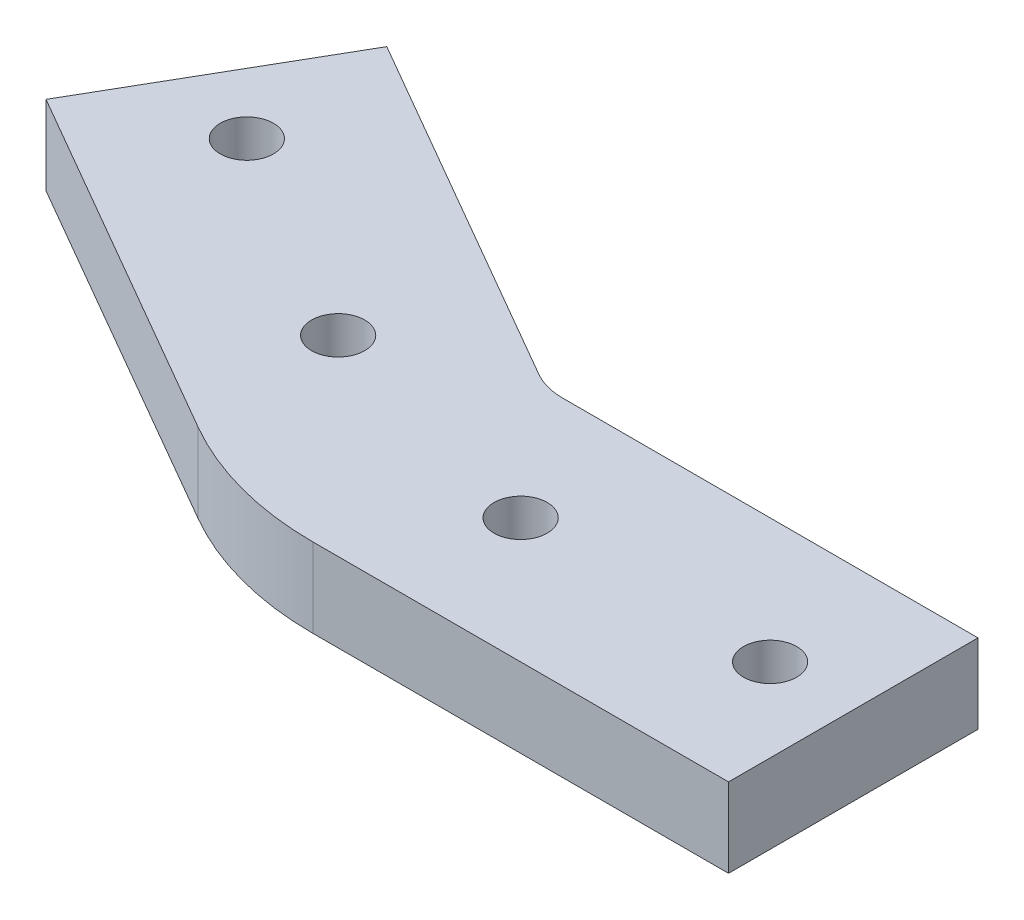
ISO-10303-21;
HEADER;
FILE_DESCRIPTION(('STEP AP214'),'2;1');
FILE_NAME('part.step','',(''),(''),'','','');
FILE_SCHEMA(('AUTOMOTIVE_DESIGN { 1 0 10303 214 1 1 1 1 }'));
ENDSEC;
DATA;
#1=APPLICATION_CONTEXT('core data for automotive mechanical design processes');
#2=APPLICATION_PROTOCOL_DEFINITION('international standard','automotive_design',2000,#1);
#3=PRODUCT_CONTEXT('',#1,'mechanical');
#4=PRODUCT('Part','Part','',(#3));
#5=PRODUCT_RELATED_PRODUCT_CATEGORY('part','',(#4));
#6=PRODUCT_DEFINITION_FORMATION('','',#4);
#7=PRODUCT_DEFINITION_CONTEXT('part definition',#1,'design');
#8=PRODUCT_DEFINITION('design','',#6,#7);
#9=PRODUCT_DEFINITION_SHAPE('','',#8);
#10=(LENGTH_UNIT() NAMED_UNIT(*) SI_UNIT(.MILLI.,.METRE.));
#11=(NAMED_UNIT(*) PLANE_ANGLE_UNIT() SI_UNIT($,.RADIAN.));
#12=(NAMED_UNIT(*) SI_UNIT($,.STERADIAN.) SOLID_ANGLE_UNIT());
#13=UNCERTAINTY_MEASURE_WITH_UNIT(LENGTH_MEASURE(1.E-05),#10,'distance_accuracy_value','');
#14=(GEOMETRIC_REPRESENTATION_CONTEXT(3) GLOBAL_UNCERTAINTY_ASSIGNED_CONTEXT((#13)) GLOBAL_UNIT_ASSIGNED_CONTEXT((#10,
#11,#12)) REPRESENTATION_CONTEXT('',''));
#15=CARTESIAN_POINT('',(0.,0.,0.));
#16=DIRECTION('',(0.,0.,1.));
#17=DIRECTION('',(1.,0.,0.));
#18=AXIS2_PLACEMENT_3D('',#15,#16,#17);
#19=CARTESIAN_POINT('',(3.03310946658286,4.7625,-11.3197186342055));
#20=DIRECTION('',(0.,-1.,0.));
#21=DIRECTION('',(0.,0.,-1.));
#22=AXIS2_PLACEMENT_3D('',#19,#20,#21);
#23=PLANE('',#22);
#24=CARTESIAN_POINT('',(-19.9472579262087,4.7625,-11.5165547332913));
#25=DIRECTION('',(0.,1.,0.));
#26=DIRECTION('',(0.,0.,1.));
#27=AXIS2_PLACEMENT_3D('',#24,#25,#26);
#28=CIRCLE('',#27,1.6);
#29=CARTESIAN_POINT('',(-19.9472579262087,4.7625,-9.91655473329132));
#30=VERTEX_POINT('',#29);
#31=EDGE_CURVE('E188',#30,#30,#28,.T.);
#32=ORIENTED_EDGE('',*,*,#31,.F.);
#33=EDGE_LOOP('',(#32));
#34=FACE_BOUND('',#33,.T.);
#35=CARTESIAN_POINT('',(23.0331094665829,4.7625,0.));
#36=DIRECTION('',(0.,1.,0.));
#37=DIRECTION('',(0.,0.,1.));
#38=AXIS2_PLACEMENT_3D('',#35,#36,#37);
#39=CIRCLE('',#38,1.6);
#40=CARTESIAN_POINT('',(23.0331094665829,4.7625,1.6));
#41=VERTEX_POINT('',#40);
#42=EDGE_CURVE('E134',#41,#41,#39,.T.);
#43=ORIENTED_EDGE('',*,*,#42,.F.);
#44=EDGE_LOOP('',(#43));
#45=FACE_BOUND('',#44,.T.);
#46=DIRECTION('',(-1.,0.,0.));
#47=VECTOR('',#46,1.);
#48=CARTESIAN_POINT('',(3.03310946658286,4.7625,-7.5));
#49=LINE('',#48,#47);
#50=CARTESIAN_POINT('',(28.0331094665829,4.7625,-7.50000000000001));
#51=VERTEX_POINT('',#50);
#52=CARTESIAN_POINT('',(3.03310946658286,4.7625,-7.5));
#53=VERTEX_POINT('',#52);
#54=EDGE_CURVE('E145',#51,#53,#49,.T.);
#55=ORIENTED_EDGE('',*,*,#54,.T.);
#56=CARTESIAN_POINT('',(3.03310946658286,4.7625,-11.3197186342055));
#57=DIRECTION('',(0.,-1.,0.));
#58=DIRECTION('',(0.,0.,1.));
#59=AXIS2_PLACEMENT_3D('',#56,#57,#58);
#60=CIRCLE('',#59,3.81971863420553);
#61=CARTESIAN_POINT('',(1.12325014948011,4.7625,-8.01174526167473));
#62=VERTEX_POINT('',#61);
#63=EDGE_CURVE('E93',#53,#62,#60,.T.);
#64=ORIENTED_EDGE('',*,*,#63,.T.);
#65=DIRECTION('',(-0.866025403784442,0.,-0.499999999999995));
#66=VECTOR('',#65,1.);
#67=CARTESIAN_POINT('',(-20.5273849451309,4.7625,-20.5117452616746));
#68=LINE('',#67,#66);
#69=CARTESIAN_POINT('',(-20.5273849451309,4.7625,-20.5117452616746));
#70=VERTEX_POINT('',#69);
#71=EDGE_CURVE('E160',#62,#70,#68,.T.);
#72=ORIENTED_EDGE('',*,*,#71,.T.);
#73=DIRECTION('',(-0.499999999999995,0.,0.866025403784441));
#74=VECTOR('',#73,1.);
#75=CARTESIAN_POINT('',(-28.0273849451308,4.7625,-7.52136420490798));
#76=LINE('',#75,#74);
#77=CARTESIAN_POINT('',(-28.0273849451308,4.7625,-7.52136420490798));
#78=VERTEX_POINT('',#77);
#79=EDGE_CURVE('E173',#70,#78,#76,.T.);
#80=ORIENTED_EDGE('',*,*,#79,.T.);
#81=DIRECTION('',(0.866025403784442,0.,0.499999999999995));
#82=VECTOR('',#81,1.);
#83=CARTESIAN_POINT('',(-6.37674985051981,4.7625,4.97863579509189));
#84=LINE('',#83,#82);
#85=CARTESIAN_POINT('',(-6.37674985051981,4.7625,4.9786357950919));
#86=VERTEX_POINT('',#85);
#87=EDGE_CURVE('E112',#78,#86,#84,.T.);
#88=ORIENTED_EDGE('',*,*,#87,.T.);
#89=CARTESIAN_POINT('',(3.03310946658286,4.7625,-11.3197186342055));
#90=DIRECTION('',(0.,1.,0.));
#91=DIRECTION('',(0.,0.,-1.));
#92=AXIS2_PLACEMENT_3D('',#89,#90,#91);
#93=CIRCLE('',#92,18.8197186342055);
#94=CARTESIAN_POINT('',(3.03310946658286,4.7625,7.5));
#95=VERTEX_POINT('',#94);
#96=EDGE_CURVE('E106',#86,#95,#93,.T.);
#97=ORIENTED_EDGE('',*,*,#96,.T.);
#98=DIRECTION('',(1.,0.,0.));
#99=VECTOR('',#98,1.);
#100=CARTESIAN_POINT('',(28.0331094665829,4.7625,7.49999999999999));
#101=LINE('',#100,#99);
#102=CARTESIAN_POINT('',(28.0331094665829,4.7625,7.49999999999999));
#103=VERTEX_POINT('',#102);
#104=EDGE_CURVE('E110',#95,#103,#101,.T.);
#105=ORIENTED_EDGE('',*,*,#104,.T.);
#106=DIRECTION('',(0.,0.,-1.));
#107=VECTOR('',#106,1.);
#108=CARTESIAN_POINT('',(28.0331094665829,4.7625,-7.50000000000001));
#109=LINE('',#108,#107);
#110=EDGE_CURVE('E50',#103,#51,#109,.T.);
#111=ORIENTED_EDGE('',*,*,#110,.T.);
#112=EDGE_LOOP('',(#55,#64,#72,#80,#88,#97,#105,#111));
#113=FACE_BOUND('',#112,.T.);
#114=CARTESIAN_POINT('',(8.03310946658287,4.7625,0.));
#115=DIRECTION('',(0.,1.,0.));
#116=DIRECTION('',(0.,0.,1.));
#117=AXIS2_PLACEMENT_3D('',#114,#115,#116);
#118=CIRCLE('',#117,1.6);
#119=CARTESIAN_POINT('',(8.03310946658287,4.7625,1.6));
#120=VERTEX_POINT('',#119);
#121=EDGE_CURVE('E182',#120,#120,#118,.T.);
#122=ORIENTED_EDGE('',*,*,#121,.F.);
#123=EDGE_LOOP('',(#122));
#124=FACE_BOUND('',#123,.T.);
#125=CARTESIAN_POINT('',(-6.95687686944206,4.7625,-4.0165547332914));
#126=DIRECTION('',(0.,1.,0.));
#127=DIRECTION('',(0.,0.,1.));
#128=AXIS2_PLACEMENT_3D('',#125,#126,#127);
#129=CIRCLE('',#128,1.6);
#130=CARTESIAN_POINT('',(-6.95687686944206,4.7625,-2.4165547332914));
#131=VERTEX_POINT('',#130);
#132=EDGE_CURVE('E194',#131,#131,#129,.T.);
#133=ORIENTED_EDGE('',*,*,#132,.F.);
#134=EDGE_LOOP('',(#133));
#135=FACE_BOUND('',#134,.T.);
#136=ADVANCED_FACE('F33',(#34,#45,#113,#124,#135),#23,.F.);
#137=CARTESIAN_POINT('',(3.03310946658286,0.,-11.3197186342055));
#138=DIRECTION('',(0.,-1.,0.));
#139=DIRECTION('',(0.,0.,-1.));
#140=AXIS2_PLACEMENT_3D('',#137,#138,#139);
#141=PLANE('',#140);
#142=CARTESIAN_POINT('',(-19.9472579262087,0.,-11.5165547332913));
#143=DIRECTION('',(0.,1.,0.));
#144=DIRECTION('',(0.,0.,1.));
#145=AXIS2_PLACEMENT_3D('',#142,#143,#144);
#146=CIRCLE('',#145,1.6);
#147=CARTESIAN_POINT('',(-19.9472579262087,0.,-9.91655473329132));
#148=VERTEX_POINT('',#147);
#149=EDGE_CURVE('E191',#148,#148,#146,.T.);
#150=ORIENTED_EDGE('',*,*,#149,.T.);
#151=EDGE_LOOP('',(#150));
#152=FACE_BOUND('',#151,.T.);
#153=CARTESIAN_POINT('',(23.0331094665829,0.,0.));
#154=DIRECTION('',(0.,1.,0.));
#155=DIRECTION('',(0.,0.,1.));
#156=AXIS2_PLACEMENT_3D('',#153,#154,#155);
#157=CIRCLE('',#156,1.6);
#158=CARTESIAN_POINT('',(23.0331094665829,0.,1.6));
#159=VERTEX_POINT('',#158);
#160=EDGE_CURVE('E179',#159,#159,#157,.T.);
#161=ORIENTED_EDGE('',*,*,#160,.T.);
#162=EDGE_LOOP('',(#161));
#163=FACE_BOUND('',#162,.T.);
#164=DIRECTION('',(-1.,0.,0.));
#165=VECTOR('',#164,1.);
#166=CARTESIAN_POINT('',(3.03310946658286,0.,-7.5));
#167=LINE('',#166,#165);
#168=CARTESIAN_POINT('',(28.0331094665829,0.,-7.50000000000001));
#169=VERTEX_POINT('',#168);
#170=CARTESIAN_POINT('',(3.03310946658286,0.,-7.5));
#171=VERTEX_POINT('',#170);
#172=EDGE_CURVE('E130',#169,#171,#167,.T.);
#173=ORIENTED_EDGE('',*,*,#172,.F.);
#174=DIRECTION('',(0.,0.,-1.));
#175=VECTOR('',#174,1.);
#176=CARTESIAN_POINT('',(28.0331094665829,0.,-7.50000000000001));
#177=LINE('',#176,#175);
#178=CARTESIAN_POINT('',(28.0331094665829,0.,7.49999999999999));
#179=VERTEX_POINT('',#178);
#180=EDGE_CURVE('E85',#179,#169,#177,.T.);
#181=ORIENTED_EDGE('',*,*,#180,.F.);
#182=DIRECTION('',(1.,0.,0.));
#183=VECTOR('',#182,1.);
#184=CARTESIAN_POINT('',(28.0331094665829,0.,7.49999999999999));
#185=LINE('',#184,#183);
#186=CARTESIAN_POINT('',(3.03310946658286,0.,7.5));
#187=VERTEX_POINT('',#186);
#188=EDGE_CURVE('E79',#187,#179,#185,.T.);
#189=ORIENTED_EDGE('',*,*,#188,.F.);
#190=CARTESIAN_POINT('',(3.03310946658286,0.,-11.3197186342055));
#191=DIRECTION('',(0.,1.,0.));
#192=DIRECTION('',(0.,0.,-1.));
#193=AXIS2_PLACEMENT_3D('',#190,#191,#192);
#194=CIRCLE('',#193,18.8197186342055);
#195=CARTESIAN_POINT('',(-6.37674985051981,0.,4.9786357950919));
#196=VERTEX_POINT('',#195);
#197=EDGE_CURVE('E120',#196,#187,#194,.T.);
#198=ORIENTED_EDGE('',*,*,#197,.F.);
#199=DIRECTION('',(0.866025403784442,0.,0.499999999999995));
#200=VECTOR('',#199,1.);
#201=CARTESIAN_POINT('',(-6.37674985051981,0.,4.97863579509189));
#202=LINE('',#201,#200);
#203=CARTESIAN_POINT('',(-28.0273849451308,0.,-7.52136420490798));
#204=VERTEX_POINT('',#203);
#205=EDGE_CURVE('E140',#204,#196,#202,.T.);
#206=ORIENTED_EDGE('',*,*,#205,.F.);
#207=DIRECTION('',(-0.499999999999995,0.,0.866025403784441));
#208=VECTOR('',#207,1.);
#209=CARTESIAN_POINT('',(-28.0273849451308,0.,-7.52136420490798));
#210=LINE('',#209,#208);
#211=CARTESIAN_POINT('',(-20.5273849451309,0.,-20.5117452616746));
#212=VERTEX_POINT('',#211);
#213=EDGE_CURVE('E138',#212,#204,#210,.T.);
#214=ORIENTED_EDGE('',*,*,#213,.F.);
#215=DIRECTION('',(-0.866025403784442,0.,-0.499999999999995));
#216=VECTOR('',#215,1.);
#217=CARTESIAN_POINT('',(-20.5273849451309,0.,-20.5117452616746));
#218=LINE('',#217,#216);
#219=CARTESIAN_POINT('',(1.12325014948011,0.,-8.01174526167473));
#220=VERTEX_POINT('',#219);
#221=EDGE_CURVE('E136',#220,#212,#218,.T.);
#222=ORIENTED_EDGE('',*,*,#221,.F.);
#223=CARTESIAN_POINT('',(3.03310946658286,0.,-11.3197186342055));
#224=DIRECTION('',(0.,-1.,0.));
#225=DIRECTION('',(0.,0.,1.));
#226=AXIS2_PLACEMENT_3D('',#223,#224,#225);
#227=CIRCLE('',#226,3.81971863420553);
#228=EDGE_CURVE('E133',#171,#220,#227,.T.);
#229=ORIENTED_EDGE('',*,*,#228,.F.);
#230=EDGE_LOOP('',(#173,#181,#189,#198,#206,#214,#222,#229));
#231=FACE_BOUND('',#230,.T.);
#232=CARTESIAN_POINT('',(8.03310946658287,0.,0.));
#233=DIRECTION('',(0.,1.,0.));
#234=DIRECTION('',(0.,0.,1.));
#235=AXIS2_PLACEMENT_3D('',#232,#233,#234);
#236=CIRCLE('',#235,1.6);
#237=CARTESIAN_POINT('',(8.03310946658287,0.,1.6));
#238=VERTEX_POINT('',#237);
#239=EDGE_CURVE('E185',#238,#238,#236,.T.);
#240=ORIENTED_EDGE('',*,*,#239,.T.);
#241=EDGE_LOOP('',(#240));
#242=FACE_BOUND('',#241,.T.);
#243=CARTESIAN_POINT('',(-6.95687686944206,0.,-4.0165547332914));
#244=DIRECTION('',(0.,1.,0.));
#245=DIRECTION('',(0.,0.,1.));
#246=AXIS2_PLACEMENT_3D('',#243,#244,#245);
#247=CIRCLE('',#246,1.6);
#248=CARTESIAN_POINT('',(-6.95687686944206,0.,-2.4165547332914));
#249=VERTEX_POINT('',#248);
#250=EDGE_CURVE('E197',#249,#249,#247,.T.);
#251=ORIENTED_EDGE('',*,*,#250,.T.);
#252=EDGE_LOOP('',(#251));
#253=FACE_BOUND('',#252,.T.);
#254=ADVANCED_FACE('F164',(#152,#163,#231,#242,#253),#141,.T.);
#255=CARTESIAN_POINT('',(3.03310946658286,4.7625,-7.5));
#256=DIRECTION('',(0.,0.,1.));
#257=DIRECTION('',(1.,0.,0.));
#258=AXIS2_PLACEMENT_3D('',#255,#256,#257);
#259=PLANE('',#258);
#260=ORIENTED_EDGE('',*,*,#172,.T.);
#261=DIRECTION('',(0.,-1.,0.));
#262=VECTOR('',#261,1.);
#263=CARTESIAN_POINT('',(3.03310946658286,4.7625,-7.5));
#264=LINE('',#263,#262);
#265=EDGE_CURVE('E11',#53,#171,#264,.T.);
#266=ORIENTED_EDGE('',*,*,#265,.F.);
#267=ORIENTED_EDGE('',*,*,#54,.F.);
#268=DIRECTION('',(0.,-1.,0.));
#269=VECTOR('',#268,1.);
#270=CARTESIAN_POINT('',(28.0331094665829,4.7625,-7.50000000000001));
#271=LINE('',#270,#269);
#272=EDGE_CURVE('E126',#51,#169,#271,.T.);
#273=ORIENTED_EDGE('',*,*,#272,.T.);
#274=EDGE_LOOP('',(#260,#266,#267,#273));
#275=FACE_BOUND('',#274,.T.);
#276=ADVANCED_FACE('F35',(#275),#259,.F.);
#277=CARTESIAN_POINT('',(3.03310946658286,4.7625,-11.3197186342055));
#278=DIRECTION('',(0.,-1.,0.));
#279=DIRECTION('',(0.,0.,-1.));
#280=AXIS2_PLACEMENT_3D('',#277,#278,#279);
#281=CYLINDRICAL_SURFACE('',#280,3.81971863420553);
#282=ORIENTED_EDGE('',*,*,#228,.T.);
#283=DIRECTION('',(0.,-1.,0.));
#284=VECTOR('',#283,1.);
#285=CARTESIAN_POINT('',(1.12325014948011,4.7625,-8.01174526167473));
#286=LINE('',#285,#284);
#287=EDGE_CURVE('E42',#62,#220,#286,.T.);
#288=ORIENTED_EDGE('',*,*,#287,.F.);
#289=ORIENTED_EDGE('',*,*,#63,.F.);
#290=ORIENTED_EDGE('',*,*,#265,.T.);
#291=EDGE_LOOP('',(#282,#288,#289,#290));
#292=FACE_BOUND('',#291,.T.);
#293=ADVANCED_FACE('F232',(#292),#281,.F.);
#294=CARTESIAN_POINT('',(-20.5273849451309,4.7625,-20.5117452616746));
#295=DIRECTION('',(-0.499999999999995,0.,0.866025403784442));
#296=DIRECTION('',(0.866025403784442,0.,0.499999999999995));
#297=AXIS2_PLACEMENT_3D('',#294,#295,#296);
#298=PLANE('',#297);
#299=ORIENTED_EDGE('',*,*,#221,.T.);
#300=DIRECTION('',(0.,-1.,0.));
#301=VECTOR('',#300,1.);
#302=CARTESIAN_POINT('',(-20.5273849451309,4.7625,-20.5117452616746));
#303=LINE('',#302,#301);
#304=EDGE_CURVE('E152',#70,#212,#303,.T.);
#305=ORIENTED_EDGE('',*,*,#304,.F.);
#306=ORIENTED_EDGE('',*,*,#71,.F.);
#307=ORIENTED_EDGE('',*,*,#287,.T.);
#308=EDGE_LOOP('',(#299,#305,#306,#307));
#309=FACE_BOUND('',#308,.T.);
#310=ADVANCED_FACE('F158',(#309),#298,.F.);
#311=CARTESIAN_POINT('',(-28.0273849451308,4.7625,-7.52136420490798));
#312=DIRECTION('',(0.866025403784442,0.,0.499999999999995));
#313=DIRECTION('',(0.499999999999995,0.,-0.866025403784442));
#314=AXIS2_PLACEMENT_3D('',#311,#312,#313);
#315=PLANE('',#314);
#316=ORIENTED_EDGE('',*,*,#213,.T.);
#317=DIRECTION('',(0.,-1.,0.));
#318=VECTOR('',#317,1.);
#319=CARTESIAN_POINT('',(-28.0273849451308,4.7625,-7.52136420490798));
#320=LINE('',#319,#318);
#321=EDGE_CURVE('E149',#78,#204,#320,.T.);
#322=ORIENTED_EDGE('',*,*,#321,.F.);
#323=ORIENTED_EDGE('',*,*,#79,.F.);
#324=ORIENTED_EDGE('',*,*,#304,.T.);
#325=EDGE_LOOP('',(#316,#322,#323,#324));
#326=FACE_BOUND('',#325,.T.);
#327=ADVANCED_FACE('F169',(#326),#315,.F.);
#328=CARTESIAN_POINT('',(-6.37674985051981,4.7625,4.97863579509189));
#329=DIRECTION('',(0.499999999999995,0.,-0.866025403784442));
#330=DIRECTION('',(-0.866025403784442,0.,-0.499999999999995));
#331=AXIS2_PLACEMENT_3D('',#328,#329,#330);
#332=PLANE('',#331);
#333=ORIENTED_EDGE('',*,*,#205,.T.);
#334=DIRECTION('',(0.,-1.,0.));
#335=VECTOR('',#334,1.);
#336=CARTESIAN_POINT('',(-6.37674985051981,4.7625,4.9786357950919));
#337=LINE('',#336,#335);
#338=EDGE_CURVE('E121',#86,#196,#337,.T.);
#339=ORIENTED_EDGE('',*,*,#338,.F.);
#340=ORIENTED_EDGE('',*,*,#87,.F.);
#341=ORIENTED_EDGE('',*,*,#321,.T.);
#342=EDGE_LOOP('',(#333,#339,#340,#341));
#343=FACE_BOUND('',#342,.T.);
#344=ADVANCED_FACE('F172',(#343),#332,.F.);
#345=CARTESIAN_POINT('',(3.03310946658286,4.7625,-11.3197186342055));
#346=DIRECTION('',(0.,-1.,0.));
#347=DIRECTION('',(0.,0.,-1.));
#348=AXIS2_PLACEMENT_3D('',#345,#346,#347);
#349=CYLINDRICAL_SURFACE('',#348,18.8197186342055);
#350=ORIENTED_EDGE('',*,*,#197,.T.);
#351=DIRECTION('',(0.,-1.,0.));
#352=VECTOR('',#351,1.);
#353=CARTESIAN_POINT('',(3.03310946658286,4.7625,7.5));
#354=LINE('',#353,#352);
#355=EDGE_CURVE('E117',#95,#187,#354,.T.);
#356=ORIENTED_EDGE('',*,*,#355,.F.);
#357=ORIENTED_EDGE('',*,*,#96,.F.);
#358=ORIENTED_EDGE('',*,*,#338,.T.);
#359=EDGE_LOOP('',(#350,#356,#357,#358));
#360=FACE_BOUND('',#359,.T.);
#361=ADVANCED_FACE('F118',(#360),#349,.T.);
#362=CARTESIAN_POINT('',(28.0331094665829,4.7625,7.49999999999999));
#363=DIRECTION('',(0.,0.,-1.));
#364=DIRECTION('',(-1.,0.,0.));
#365=AXIS2_PLACEMENT_3D('',#362,#363,#364);
#366=PLANE('',#365);
#367=ORIENTED_EDGE('',*,*,#188,.T.);
#368=DIRECTION('',(0.,-1.,0.));
#369=VECTOR('',#368,1.);
#370=CARTESIAN_POINT('',(28.0331094665829,4.7625,7.49999999999999));
#371=LINE('',#370,#369);
#372=EDGE_CURVE('E122',#103,#179,#371,.T.);
#373=ORIENTED_EDGE('',*,*,#372,.F.);
#374=ORIENTED_EDGE('',*,*,#104,.F.);
#375=ORIENTED_EDGE('',*,*,#355,.T.);
#376=EDGE_LOOP('',(#367,#373,#374,#375));
#377=FACE_BOUND('',#376,.T.);
#378=ADVANCED_FACE('F124',(#377),#366,.F.);
#379=CARTESIAN_POINT('',(28.0331094665829,4.7625,-7.50000000000001));
#380=DIRECTION('',(-1.,0.,0.));
#381=DIRECTION('',(0.,0.,1.));
#382=AXIS2_PLACEMENT_3D('',#379,#380,#381);
#383=PLANE('',#382);
#384=ORIENTED_EDGE('',*,*,#180,.T.);
#385=ORIENTED_EDGE('',*,*,#272,.F.);
#386=ORIENTED_EDGE('',*,*,#110,.F.);
#387=ORIENTED_EDGE('',*,*,#372,.T.);
#388=EDGE_LOOP('',(#384,#385,#386,#387));
#389=FACE_BOUND('',#388,.T.);
#390=ADVANCED_FACE('F220',(#389),#383,.F.);
#391=CARTESIAN_POINT('',(23.0331094665829,4.7625,0.));
#392=DIRECTION('',(0.,-1.,0.));
#393=DIRECTION('',(0.,0.,-1.));
#394=AXIS2_PLACEMENT_3D('',#391,#392,#393);
#395=CYLINDRICAL_SURFACE('',#394,1.6);
#396=ORIENTED_EDGE('',*,*,#42,.T.);
#397=EDGE_LOOP('',(#396));
#398=FACE_BOUND('',#397,.T.);
#399=ORIENTED_EDGE('',*,*,#160,.F.);
#400=EDGE_LOOP('',(#399));
#401=FACE_BOUND('',#400,.T.);
#402=ADVANCED_FACE('F217',(#398,#401),#395,.F.);
#403=CARTESIAN_POINT('',(8.03310946658287,4.7625,0.));
#404=DIRECTION('',(0.,-1.,0.));
#405=DIRECTION('',(0.,0.,-1.));
#406=AXIS2_PLACEMENT_3D('',#403,#404,#405);
#407=CYLINDRICAL_SURFACE('',#406,1.6);
#408=ORIENTED_EDGE('',*,*,#121,.T.);
#409=EDGE_LOOP('',(#408));
#410=FACE_BOUND('',#409,.T.);
#411=ORIENTED_EDGE('',*,*,#239,.F.);
#412=EDGE_LOOP('',(#411));
#413=FACE_BOUND('',#412,.T.);
#414=ADVANCED_FACE('F296',(#410,#413),#407,.F.);
#415=CARTESIAN_POINT('',(-19.9472579262087,4.7625,-11.5165547332913));
#416=DIRECTION('',(0.,-1.,0.));
#417=DIRECTION('',(0.,0.,-1.));
#418=AXIS2_PLACEMENT_3D('',#415,#416,#417);
#419=CYLINDRICAL_SURFACE('',#418,1.6);
#420=ORIENTED_EDGE('',*,*,#31,.T.);
#421=EDGE_LOOP('',(#420));
#422=FACE_BOUND('',#421,.T.);
#423=ORIENTED_EDGE('',*,*,#149,.F.);
#424=EDGE_LOOP('',(#423));
#425=FACE_BOUND('',#424,.T.);
#426=ADVANCED_FACE('F304',(#422,#425),#419,.F.);
#427=CARTESIAN_POINT('',(-6.95687686944206,4.7625,-4.0165547332914));
#428=DIRECTION('',(0.,-1.,0.));
#429=DIRECTION('',(0.,0.,-1.));
#430=AXIS2_PLACEMENT_3D('',#427,#428,#429);
#431=CYLINDRICAL_SURFACE('',#430,1.6);
#432=ORIENTED_EDGE('',*,*,#132,.T.);
#433=EDGE_LOOP('',(#432));
#434=FACE_BOUND('',#433,.T.);
#435=ORIENTED_EDGE('',*,*,#250,.F.);
#436=EDGE_LOOP('',(#435));
#437=FACE_BOUND('',#436,.T.);
#438=ADVANCED_FACE('F203',(#434,#437),#431,.F.);
#439=CLOSED_SHELL('',(#136,#254,#276,#293,#310,#327,#344,#361,#378,#390,#402,#414,#426,#438));
#440=MANIFOLD_SOLID_BREP('B2',#439);
#441=ADVANCED_BREP_SHAPE_REPRESENTATION('',(#18,#440),#14);
#442=SHAPE_DEFINITION_REPRESENTATION(#9,#441);
ENDSEC;
END-ISO-10303-21;
